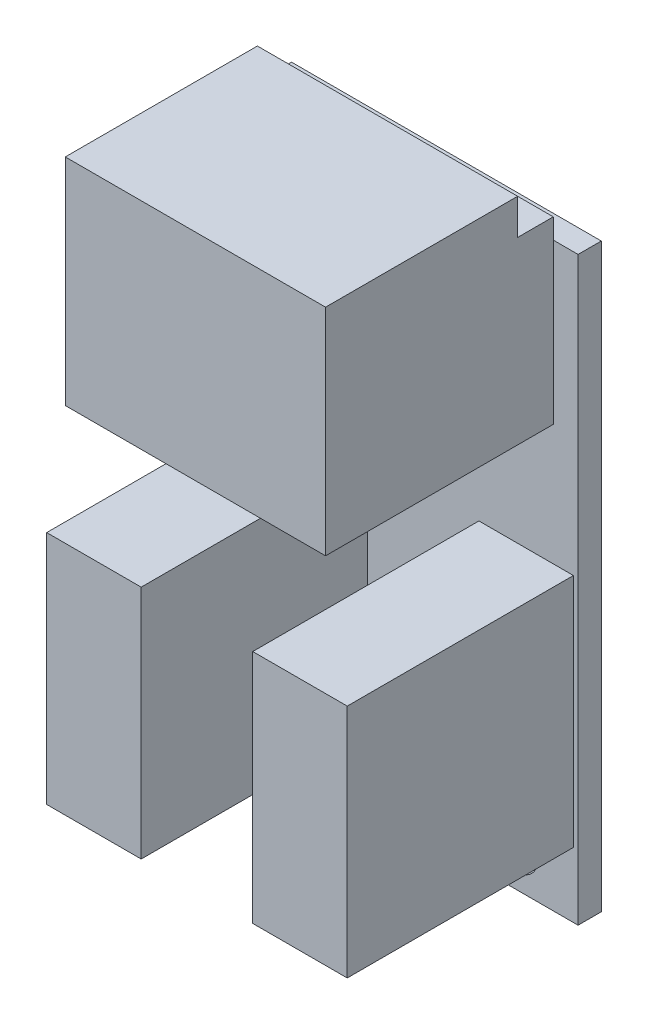
ISO-10303-21;
HEADER;
FILE_DESCRIPTION(('STEP AP214'),'2;1');
FILE_NAME('part.step','',(''),(''),'','','');
FILE_SCHEMA(('AUTOMOTIVE_DESIGN { 1 0 10303 214 1 1 1 1 }'));
ENDSEC;
DATA;
#1=APPLICATION_CONTEXT('core data for automotive mechanical design processes');
#2=APPLICATION_PROTOCOL_DEFINITION('international standard','automotive_design',2000,#1);
#3=PRODUCT_CONTEXT('',#1,'mechanical');
#4=PRODUCT('Part','Part','',(#3));
#5=PRODUCT_RELATED_PRODUCT_CATEGORY('part','',(#4));
#6=PRODUCT_DEFINITION_FORMATION('','',#4);
#7=PRODUCT_DEFINITION_CONTEXT('part definition',#1,'design');
#8=PRODUCT_DEFINITION('design','',#6,#7);
#9=PRODUCT_DEFINITION_SHAPE('','',#8);
#10=(LENGTH_UNIT() NAMED_UNIT(*) SI_UNIT(.MILLI.,.METRE.));
#11=(NAMED_UNIT(*) PLANE_ANGLE_UNIT() SI_UNIT($,.RADIAN.));
#12=(NAMED_UNIT(*) SI_UNIT($,.STERADIAN.) SOLID_ANGLE_UNIT());
#13=UNCERTAINTY_MEASURE_WITH_UNIT(LENGTH_MEASURE(1.E-05),#10,'distance_accuracy_value','');
#14=(GEOMETRIC_REPRESENTATION_CONTEXT(3) GLOBAL_UNCERTAINTY_ASSIGNED_CONTEXT((#13)) GLOBAL_UNIT_ASSIGNED_CONTEXT((#10,
#11,#12)) REPRESENTATION_CONTEXT('',''));
#15=CARTESIAN_POINT('',(0.,0.,0.));
#16=DIRECTION('',(0.,0.,1.));
#17=DIRECTION('',(1.,0.,0.));
#18=AXIS2_PLACEMENT_3D('',#15,#16,#17);
#19=CARTESIAN_POINT('',(-9.99999999999999,18.75,1.5));
#20=DIRECTION('',(0.,0.,1.));
#21=DIRECTION('',(1.,0.,0.));
#22=AXIS2_PLACEMENT_3D('',#19,#20,#21);
#23=PLANE('',#22);
#24=DIRECTION('',(1.,0.,0.));
#25=VECTOR('',#24,1.);
#26=CARTESIAN_POINT('',(-9.69999999999999,-14.55,1.5));
#27=LINE('',#26,#25);
#28=CARTESIAN_POINT('',(-9.69999999999999,-14.55,1.5));
#29=VERTEX_POINT('',#28);
#30=CARTESIAN_POINT('',(-3.59999999999999,-14.55,1.5));
#31=VERTEX_POINT('',#30);
#32=EDGE_CURVE('E194',#29,#31,#27,.T.);
#33=ORIENTED_EDGE('',*,*,#32,.F.);
#34=DIRECTION('',(0.,-1.,0.));
#35=VECTOR('',#34,1.);
#36=CARTESIAN_POINT('',(-9.7,0.650000000000003,1.5));
#37=LINE('',#36,#35);
#38=CARTESIAN_POINT('',(-9.7,0.650000000000003,1.5));
#39=VERTEX_POINT('',#38);
#40=EDGE_CURVE('E191',#39,#29,#37,.T.);
#41=ORIENTED_EDGE('',*,*,#40,.F.);
#42=DIRECTION('',(-1.,0.,0.));
#43=VECTOR('',#42,1.);
#44=CARTESIAN_POINT('',(-9.7,0.650000000000003,1.5));
#45=LINE('',#44,#43);
#46=CARTESIAN_POINT('',(-3.6,0.650000000000001,1.5));
#47=VERTEX_POINT('',#46);
#48=EDGE_CURVE('E203',#47,#39,#45,.T.);
#49=ORIENTED_EDGE('',*,*,#48,.F.);
#50=DIRECTION('',(0.,1.,0.));
#51=VECTOR('',#50,1.);
#52=CARTESIAN_POINT('',(-3.6,0.650000000000003,1.5));
#53=LINE('',#52,#51);
#54=EDGE_CURVE('E211',#31,#47,#53,.T.);
#55=ORIENTED_EDGE('',*,*,#54,.F.);
#56=EDGE_LOOP('',(#33,#41,#49,#55));
#57=FACE_BOUND('',#56,.T.);
#58=DIRECTION('',(0.,-1.,0.));
#59=VECTOR('',#58,1.);
#60=CARTESIAN_POINT('',(-8.4,8.45,1.5));
#61=LINE('',#60,#59);
#62=CARTESIAN_POINT('',(-8.4,18.75,1.5));
#63=VERTEX_POINT('',#62);
#64=CARTESIAN_POINT('',(-8.4,8.45,1.5));
#65=VERTEX_POINT('',#64);
#66=EDGE_CURVE('E11',#63,#65,#61,.T.);
#67=ORIENTED_EDGE('',*,*,#66,.F.);
#68=DIRECTION('',(-1.,0.,0.));
#69=VECTOR('',#68,1.);
#70=CARTESIAN_POINT('',(10.,18.75,1.5));
#71=LINE('',#70,#69);
#72=CARTESIAN_POINT('',(-9.99999999999999,18.75,1.5));
#73=VERTEX_POINT('',#72);
#74=EDGE_CURVE('E300',#63,#73,#71,.T.);
#75=ORIENTED_EDGE('',*,*,#74,.T.);
#76=DIRECTION('',(0.,-1.,0.));
#77=VECTOR('',#76,1.);
#78=CARTESIAN_POINT('',(-9.99999999999999,-18.75,1.5));
#79=LINE('',#78,#77);
#80=CARTESIAN_POINT('',(-9.99999999999999,-18.75,1.5));
#81=VERTEX_POINT('',#80);
#82=EDGE_CURVE('E289',#73,#81,#79,.T.);
#83=ORIENTED_EDGE('',*,*,#82,.T.);
#84=DIRECTION('',(1.,0.,0.));
#85=VECTOR('',#84,1.);
#86=CARTESIAN_POINT('',(10.,-18.75,1.5));
#87=LINE('',#86,#85);
#88=CARTESIAN_POINT('',(10.,-18.75,1.5));
#89=VERTEX_POINT('',#88);
#90=EDGE_CURVE('E303',#81,#89,#87,.T.);
#91=ORIENTED_EDGE('',*,*,#90,.T.);
#92=DIRECTION('',(0.,1.,0.));
#93=VECTOR('',#92,1.);
#94=CARTESIAN_POINT('',(10.,-18.75,1.5));
#95=LINE('',#94,#93);
#96=CARTESIAN_POINT('',(10.,18.75,1.5));
#97=VERTEX_POINT('',#96);
#98=EDGE_CURVE('E301',#89,#97,#95,.T.);
#99=ORIENTED_EDGE('',*,*,#98,.T.);
#100=CARTESIAN_POINT('',(8.4,18.75,1.5));
#101=VERTEX_POINT('',#100);
#102=EDGE_CURVE('E286',#97,#101,#71,.T.);
#103=ORIENTED_EDGE('',*,*,#102,.T.);
#104=DIRECTION('',(0.,1.,0.));
#105=VECTOR('',#104,1.);
#106=CARTESIAN_POINT('',(8.4,8.45000000000001,1.5));
#107=LINE('',#106,#105);
#108=CARTESIAN_POINT('',(8.4,8.45000000000001,1.5));
#109=VERTEX_POINT('',#108);
#110=EDGE_CURVE('E318',#109,#101,#107,.T.);
#111=ORIENTED_EDGE('',*,*,#110,.F.);
#112=DIRECTION('',(1.,0.,0.));
#113=VECTOR('',#112,1.);
#114=CARTESIAN_POINT('',(8.4,8.45000000000001,1.5));
#115=LINE('',#114,#113);
#116=EDGE_CURVE('E249',#65,#109,#115,.T.);
#117=ORIENTED_EDGE('',*,*,#116,.F.);
#118=EDGE_LOOP('',(#67,#75,#83,#91,#99,#103,#111,#117));
#119=FACE_BOUND('',#118,.T.);
#120=CARTESIAN_POINT('',(-6.05,-16.4,1.5));
#121=DIRECTION('',(0.,0.,1.));
#122=DIRECTION('',(1.,0.,0.));
#123=AXIS2_PLACEMENT_3D('',#120,#121,#122);
#124=CIRCLE('',#123,1.35);
#125=CARTESIAN_POINT('',(-4.7,-16.4,1.5));
#126=VERTEX_POINT('',#125);
#127=EDGE_CURVE('E297',#126,#126,#124,.T.);
#128=ORIENTED_EDGE('',*,*,#127,.F.);
#129=EDGE_LOOP('',(#128));
#130=FACE_BOUND('',#129,.T.);
#131=CARTESIAN_POINT('',(6.05,-16.4,1.5));
#132=DIRECTION('',(0.,0.,1.));
#133=DIRECTION('',(1.,0.,0.));
#134=AXIS2_PLACEMENT_3D('',#131,#132,#133);
#135=CIRCLE('',#134,1.35);
#136=CARTESIAN_POINT('',(7.4,-16.4,1.5));
#137=VERTEX_POINT('',#136);
#138=EDGE_CURVE('E310',#137,#137,#135,.T.);
#139=ORIENTED_EDGE('',*,*,#138,.F.);
#140=EDGE_LOOP('',(#139));
#141=FACE_BOUND('',#140,.T.);
#142=DIRECTION('',(-1.,0.,0.));
#143=VECTOR('',#142,1.);
#144=CARTESIAN_POINT('',(9.7,0.650000000000003,1.5));
#145=LINE('',#144,#143);
#146=CARTESIAN_POINT('',(9.7,0.650000000000003,1.5));
#147=VERTEX_POINT('',#146);
#148=CARTESIAN_POINT('',(3.6,0.650000000000002,1.5));
#149=VERTEX_POINT('',#148);
#150=EDGE_CURVE('E608',#147,#149,#145,.T.);
#151=ORIENTED_EDGE('',*,*,#150,.F.);
#152=DIRECTION('',(0.,1.,0.));
#153=VECTOR('',#152,1.);
#154=CARTESIAN_POINT('',(9.7,0.650000000000003,1.5));
#155=LINE('',#154,#153);
#156=CARTESIAN_POINT('',(9.7,-14.55,1.5));
#157=VERTEX_POINT('',#156);
#158=EDGE_CURVE('E189',#157,#147,#155,.T.);
#159=ORIENTED_EDGE('',*,*,#158,.F.);
#160=DIRECTION('',(1.,0.,0.));
#161=VECTOR('',#160,1.);
#162=CARTESIAN_POINT('',(9.7,-14.55,1.5));
#163=LINE('',#162,#161);
#164=CARTESIAN_POINT('',(3.6,-14.55,1.5));
#165=VERTEX_POINT('',#164);
#166=EDGE_CURVE('E185',#165,#157,#163,.T.);
#167=ORIENTED_EDGE('',*,*,#166,.F.);
#168=DIRECTION('',(0.,-1.,0.));
#169=VECTOR('',#168,1.);
#170=CARTESIAN_POINT('',(3.6,0.650000000000002,1.5));
#171=LINE('',#170,#169);
#172=EDGE_CURVE('E610',#149,#165,#171,.T.);
#173=ORIENTED_EDGE('',*,*,#172,.F.);
#174=EDGE_LOOP('',(#151,#159,#167,#173));
#175=FACE_BOUND('',#174,.T.);
#176=ADVANCED_FACE('F31',(#57,#119,#130,#141,#175),#23,.T.);
#177=CARTESIAN_POINT('',(-9.99999999999999,18.75,0.));
#178=DIRECTION('',(0.,0.,1.));
#179=DIRECTION('',(1.,0.,0.));
#180=AXIS2_PLACEMENT_3D('',#177,#178,#179);
#181=PLANE('',#180);
#182=CARTESIAN_POINT('',(-6.05,-16.4,0.));
#183=DIRECTION('',(0.,0.,1.));
#184=DIRECTION('',(1.,0.,0.));
#185=AXIS2_PLACEMENT_3D('',#182,#183,#184);
#186=CIRCLE('',#185,1.35);
#187=CARTESIAN_POINT('',(-4.7,-16.4,0.));
#188=VERTEX_POINT('',#187);
#189=EDGE_CURVE('E307',#188,#188,#186,.T.);
#190=ORIENTED_EDGE('',*,*,#189,.T.);
#191=EDGE_LOOP('',(#190));
#192=FACE_BOUND('',#191,.T.);
#193=DIRECTION('',(0.,-1.,0.));
#194=VECTOR('',#193,1.);
#195=CARTESIAN_POINT('',(-9.99999999999999,-18.75,0.));
#196=LINE('',#195,#194);
#197=CARTESIAN_POINT('',(-9.99999999999999,18.75,0.));
#198=VERTEX_POINT('',#197);
#199=CARTESIAN_POINT('',(-9.99999999999999,-18.75,0.));
#200=VERTEX_POINT('',#199);
#201=EDGE_CURVE('E294',#198,#200,#196,.T.);
#202=ORIENTED_EDGE('',*,*,#201,.F.);
#203=DIRECTION('',(-1.,0.,0.));
#204=VECTOR('',#203,1.);
#205=CARTESIAN_POINT('',(10.,18.75,0.));
#206=LINE('',#205,#204);
#207=CARTESIAN_POINT('',(10.,18.75,0.));
#208=VERTEX_POINT('',#207);
#209=EDGE_CURVE('E287',#208,#198,#206,.T.);
#210=ORIENTED_EDGE('',*,*,#209,.F.);
#211=DIRECTION('',(0.,1.,0.));
#212=VECTOR('',#211,1.);
#213=CARTESIAN_POINT('',(10.,-18.75,0.));
#214=LINE('',#213,#212);
#215=CARTESIAN_POINT('',(10.,-18.75,0.));
#216=VERTEX_POINT('',#215);
#217=EDGE_CURVE('E290',#216,#208,#214,.T.);
#218=ORIENTED_EDGE('',*,*,#217,.F.);
#219=DIRECTION('',(1.,0.,0.));
#220=VECTOR('',#219,1.);
#221=CARTESIAN_POINT('',(10.,-18.75,0.));
#222=LINE('',#221,#220);
#223=EDGE_CURVE('E292',#200,#216,#222,.T.);
#224=ORIENTED_EDGE('',*,*,#223,.F.);
#225=EDGE_LOOP('',(#202,#210,#218,#224));
#226=FACE_BOUND('',#225,.T.);
#227=CARTESIAN_POINT('',(6.05,-16.4,0.));
#228=DIRECTION('',(0.,0.,1.));
#229=DIRECTION('',(1.,0.,0.));
#230=AXIS2_PLACEMENT_3D('',#227,#228,#229);
#231=CIRCLE('',#230,1.35);
#232=CARTESIAN_POINT('',(7.4,-16.4,0.));
#233=VERTEX_POINT('',#232);
#234=EDGE_CURVE('E266',#233,#233,#231,.T.);
#235=ORIENTED_EDGE('',*,*,#234,.T.);
#236=EDGE_LOOP('',(#235));
#237=FACE_BOUND('',#236,.T.);
#238=ADVANCED_FACE('F352',(#192,#226,#237),#181,.F.);
#239=CARTESIAN_POINT('',(-9.99999999999999,-18.75,1.5));
#240=DIRECTION('',(1.,0.,0.));
#241=DIRECTION('',(0.,0.,-1.));
#242=AXIS2_PLACEMENT_3D('',#239,#240,#241);
#243=PLANE('',#242);
#244=ORIENTED_EDGE('',*,*,#201,.T.);
#245=DIRECTION('',(0.,0.,-1.));
#246=VECTOR('',#245,1.);
#247=CARTESIAN_POINT('',(-9.99999999999999,-18.75,1.5));
#248=LINE('',#247,#246);
#249=EDGE_CURVE('E40',#81,#200,#248,.T.);
#250=ORIENTED_EDGE('',*,*,#249,.F.);
#251=ORIENTED_EDGE('',*,*,#82,.F.);
#252=DIRECTION('',(0.,0.,-1.));
#253=VECTOR('',#252,1.);
#254=CARTESIAN_POINT('',(-9.99999999999999,18.75,1.5));
#255=LINE('',#254,#253);
#256=EDGE_CURVE('E283',#73,#198,#255,.T.);
#257=ORIENTED_EDGE('',*,*,#256,.T.);
#258=EDGE_LOOP('',(#244,#250,#251,#257));
#259=FACE_BOUND('',#258,.T.);
#260=ADVANCED_FACE('F33',(#259),#243,.F.);
#261=CARTESIAN_POINT('',(10.,-18.75,1.5));
#262=DIRECTION('',(0.,1.,0.));
#263=DIRECTION('',(-1.,0.,0.));
#264=AXIS2_PLACEMENT_3D('',#261,#262,#263);
#265=PLANE('',#264);
#266=ORIENTED_EDGE('',*,*,#223,.T.);
#267=DIRECTION('',(0.,0.,-1.));
#268=VECTOR('',#267,1.);
#269=CARTESIAN_POINT('',(10.,-18.75,1.5));
#270=LINE('',#269,#268);
#271=EDGE_CURVE('E277',#89,#216,#270,.T.);
#272=ORIENTED_EDGE('',*,*,#271,.F.);
#273=ORIENTED_EDGE('',*,*,#90,.F.);
#274=ORIENTED_EDGE('',*,*,#249,.T.);
#275=EDGE_LOOP('',(#266,#272,#273,#274));
#276=FACE_BOUND('',#275,.T.);
#277=ADVANCED_FACE('F372',(#276),#265,.F.);
#278=CARTESIAN_POINT('',(10.,-18.75,1.5));
#279=DIRECTION('',(-1.,0.,0.));
#280=DIRECTION('',(0.,0.,1.));
#281=AXIS2_PLACEMENT_3D('',#278,#279,#280);
#282=PLANE('',#281);
#283=ORIENTED_EDGE('',*,*,#217,.T.);
#284=DIRECTION('',(0.,0.,-1.));
#285=VECTOR('',#284,1.);
#286=CARTESIAN_POINT('',(10.,18.75,1.5));
#287=LINE('',#286,#285);
#288=EDGE_CURVE('E280',#97,#208,#287,.T.);
#289=ORIENTED_EDGE('',*,*,#288,.F.);
#290=ORIENTED_EDGE('',*,*,#98,.F.);
#291=ORIENTED_EDGE('',*,*,#271,.T.);
#292=EDGE_LOOP('',(#283,#289,#290,#291));
#293=FACE_BOUND('',#292,.T.);
#294=ADVANCED_FACE('F369',(#293),#282,.F.);
#295=CARTESIAN_POINT('',(10.,18.75,1.5));
#296=DIRECTION('',(0.,-1.,0.));
#297=DIRECTION('',(1.,0.,0.));
#298=AXIS2_PLACEMENT_3D('',#295,#296,#297);
#299=PLANE('',#298);
#300=ORIENTED_EDGE('',*,*,#209,.T.);
#301=ORIENTED_EDGE('',*,*,#256,.F.);
#302=ORIENTED_EDGE('',*,*,#74,.F.);
#303=EDGE_CURVE('E299',#101,#63,#71,.T.);
#304=ORIENTED_EDGE('',*,*,#303,.F.);
#305=ORIENTED_EDGE('',*,*,#102,.F.);
#306=ORIENTED_EDGE('',*,*,#288,.T.);
#307=EDGE_LOOP('',(#300,#301,#302,#304,#305,#306));
#308=FACE_BOUND('',#307,.T.);
#309=ADVANCED_FACE('F366',(#308),#299,.F.);
#310=CARTESIAN_POINT('',(-6.05,-16.4,1.5));
#311=DIRECTION('',(0.,0.,-1.));
#312=DIRECTION('',(-1.,0.,0.));
#313=AXIS2_PLACEMENT_3D('',#310,#311,#312);
#314=CYLINDRICAL_SURFACE('',#313,1.35);
#315=ORIENTED_EDGE('',*,*,#127,.T.);
#316=EDGE_LOOP('',(#315));
#317=FACE_BOUND('',#316,.T.);
#318=ORIENTED_EDGE('',*,*,#189,.F.);
#319=EDGE_LOOP('',(#318));
#320=FACE_BOUND('',#319,.T.);
#321=ADVANCED_FACE('F363',(#317,#320),#314,.F.);
#322=CARTESIAN_POINT('',(6.05,-16.4,1.5));
#323=DIRECTION('',(0.,0.,-1.));
#324=DIRECTION('',(-1.,0.,0.));
#325=AXIS2_PLACEMENT_3D('',#322,#323,#324);
#326=CYLINDRICAL_SURFACE('',#325,1.35);
#327=ORIENTED_EDGE('',*,*,#138,.T.);
#328=EDGE_LOOP('',(#327));
#329=FACE_BOUND('',#328,.T.);
#330=ORIENTED_EDGE('',*,*,#234,.F.);
#331=EDGE_LOOP('',(#330));
#332=FACE_BOUND('',#331,.T.);
#333=ADVANCED_FACE('F546',(#329,#332),#326,.F.);
#334=CARTESIAN_POINT('',(8.4,8.45000000000001,3.8));
#335=DIRECTION('',(0.,1.,0.));
#336=DIRECTION('',(-1.,0.,0.));
#337=AXIS2_PLACEMENT_3D('',#334,#335,#336);
#338=PLANE('',#337);
#339=ORIENTED_EDGE('',*,*,#116,.T.);
#340=DIRECTION('',(0.,0.,-1.));
#341=VECTOR('',#340,1.);
#342=CARTESIAN_POINT('',(8.4,8.45000000000001,3.8));
#343=LINE('',#342,#341);
#344=CARTESIAN_POINT('',(8.4,8.45,16.2));
#345=VERTEX_POINT('',#344);
#346=EDGE_CURVE('E260',#345,#109,#343,.T.);
#347=ORIENTED_EDGE('',*,*,#346,.F.);
#348=DIRECTION('',(1.,0.,0.));
#349=VECTOR('',#348,1.);
#350=CARTESIAN_POINT('',(-8.4,8.45,16.2));
#351=LINE('',#350,#349);
#352=CARTESIAN_POINT('',(-8.4,8.45,16.2));
#353=VERTEX_POINT('',#352);
#354=EDGE_CURVE('E226',#353,#345,#351,.T.);
#355=ORIENTED_EDGE('',*,*,#354,.F.);
#356=DIRECTION('',(0.,0.,-1.));
#357=VECTOR('',#356,1.);
#358=CARTESIAN_POINT('',(-8.4,8.45,3.8));
#359=LINE('',#358,#357);
#360=EDGE_CURVE('E255',#353,#65,#359,.T.);
#361=ORIENTED_EDGE('',*,*,#360,.T.);
#362=EDGE_LOOP('',(#339,#347,#355,#361));
#363=FACE_BOUND('',#362,.T.);
#364=ADVANCED_FACE('F398',(#363),#338,.F.);
#365=CARTESIAN_POINT('',(8.4,8.45000000000001,3.8));
#366=DIRECTION('',(-1.,0.,0.));
#367=DIRECTION('',(0.,-1.,0.));
#368=AXIS2_PLACEMENT_3D('',#365,#366,#367);
#369=PLANE('',#368);
#370=ORIENTED_EDGE('',*,*,#110,.T.);
#371=CARTESIAN_POINT('',(8.4,20.05,1.5));
#372=VERTEX_POINT('',#371);
#373=EDGE_CURVE('E320',#101,#372,#107,.T.);
#374=ORIENTED_EDGE('',*,*,#373,.T.);
#375=DIRECTION('',(0.,0.,-1.));
#376=VECTOR('',#375,1.);
#377=CARTESIAN_POINT('',(8.4,20.05,3.8));
#378=LINE('',#377,#376);
#379=CARTESIAN_POINT('',(8.4,20.05,3.8));
#380=VERTEX_POINT('',#379);
#381=EDGE_CURVE('E258',#380,#372,#378,.T.);
#382=ORIENTED_EDGE('',*,*,#381,.F.);
#383=DIRECTION('',(0.,1.,0.));
#384=VECTOR('',#383,1.);
#385=CARTESIAN_POINT('',(8.4,8.45,3.8));
#386=LINE('',#385,#384);
#387=CARTESIAN_POINT('',(8.4,22.35,3.8));
#388=VERTEX_POINT('',#387);
#389=EDGE_CURVE('E243',#380,#388,#386,.T.);
#390=ORIENTED_EDGE('',*,*,#389,.T.);
#391=DIRECTION('',(0.,0.,-1.));
#392=VECTOR('',#391,1.);
#393=CARTESIAN_POINT('',(8.4,22.35,16.2));
#394=LINE('',#393,#392);
#395=CARTESIAN_POINT('',(8.4,22.35,16.2));
#396=VERTEX_POINT('',#395);
#397=EDGE_CURVE('E244',#396,#388,#394,.T.);
#398=ORIENTED_EDGE('',*,*,#397,.F.);
#399=DIRECTION('',(0.,1.,0.));
#400=VECTOR('',#399,1.);
#401=CARTESIAN_POINT('',(8.4,8.45,16.2));
#402=LINE('',#401,#400);
#403=EDGE_CURVE('E230',#345,#396,#402,.T.);
#404=ORIENTED_EDGE('',*,*,#403,.F.);
#405=ORIENTED_EDGE('',*,*,#346,.T.);
#406=EDGE_LOOP('',(#370,#374,#382,#390,#398,#404,#405));
#407=FACE_BOUND('',#406,.T.);
#408=ADVANCED_FACE('F349',(#407),#369,.F.);
#409=CARTESIAN_POINT('',(8.4,20.05,3.8));
#410=DIRECTION('',(0.,-1.,0.));
#411=DIRECTION('',(1.,0.,0.));
#412=AXIS2_PLACEMENT_3D('',#409,#410,#411);
#413=PLANE('',#412);
#414=DIRECTION('',(-1.,0.,0.));
#415=VECTOR('',#414,1.);
#416=CARTESIAN_POINT('',(8.4,20.05,1.5));
#417=LINE('',#416,#415);
#418=CARTESIAN_POINT('',(-8.4,20.05,1.5));
#419=VERTEX_POINT('',#418);
#420=EDGE_CURVE('E317',#372,#419,#417,.T.);
#421=ORIENTED_EDGE('',*,*,#420,.T.);
#422=DIRECTION('',(0.,0.,-1.));
#423=VECTOR('',#422,1.);
#424=CARTESIAN_POINT('',(-8.4,20.05,3.8));
#425=LINE('',#424,#423);
#426=CARTESIAN_POINT('',(-8.4,20.05,3.8));
#427=VERTEX_POINT('',#426);
#428=EDGE_CURVE('E261',#427,#419,#425,.T.);
#429=ORIENTED_EDGE('',*,*,#428,.F.);
#430=DIRECTION('',(-1.,0.,0.));
#431=VECTOR('',#430,1.);
#432=CARTESIAN_POINT('',(8.4,20.05,3.8));
#433=LINE('',#432,#431);
#434=EDGE_CURVE('E252',#380,#427,#433,.T.);
#435=ORIENTED_EDGE('',*,*,#434,.F.);
#436=ORIENTED_EDGE('',*,*,#381,.T.);
#437=EDGE_LOOP('',(#421,#429,#435,#436));
#438=FACE_BOUND('',#437,.T.);
#439=ADVANCED_FACE('F341',(#438),#413,.F.);
#440=CARTESIAN_POINT('',(-8.4,8.45,3.8));
#441=DIRECTION('',(1.,0.,0.));
#442=DIRECTION('',(0.,1.,0.));
#443=AXIS2_PLACEMENT_3D('',#440,#441,#442);
#444=PLANE('',#443);
#445=EDGE_CURVE('E42',#419,#63,#61,.T.);
#446=ORIENTED_EDGE('',*,*,#445,.T.);
#447=ORIENTED_EDGE('',*,*,#66,.T.);
#448=ORIENTED_EDGE('',*,*,#360,.F.);
#449=DIRECTION('',(0.,-1.,0.));
#450=VECTOR('',#449,1.);
#451=CARTESIAN_POINT('',(-8.4,8.45,16.2));
#452=LINE('',#451,#450);
#453=CARTESIAN_POINT('',(-8.4,22.35,16.2));
#454=VERTEX_POINT('',#453);
#455=EDGE_CURVE('E223',#454,#353,#452,.T.);
#456=ORIENTED_EDGE('',*,*,#455,.F.);
#457=DIRECTION('',(0.,0.,-1.));
#458=VECTOR('',#457,1.);
#459=CARTESIAN_POINT('',(-8.4,22.35,16.2));
#460=LINE('',#459,#458);
#461=CARTESIAN_POINT('',(-8.4,22.35,3.8));
#462=VERTEX_POINT('',#461);
#463=EDGE_CURVE('E234',#454,#462,#460,.T.);
#464=ORIENTED_EDGE('',*,*,#463,.T.);
#465=DIRECTION('',(0.,-1.,0.));
#466=VECTOR('',#465,1.);
#467=CARTESIAN_POINT('',(-8.4,8.45,3.8));
#468=LINE('',#467,#466);
#469=EDGE_CURVE('E222',#462,#427,#468,.T.);
#470=ORIENTED_EDGE('',*,*,#469,.T.);
#471=ORIENTED_EDGE('',*,*,#428,.T.);
#472=EDGE_LOOP('',(#446,#447,#448,#456,#464,#470,#471));
#473=FACE_BOUND('',#472,.T.);
#474=ADVANCED_FACE('F338',(#473),#444,.F.);
#475=CARTESIAN_POINT('',(-8.4,8.45,1.5));
#476=DIRECTION('',(0.,0.,-1.));
#477=DIRECTION('',(-1.,0.,0.));
#478=AXIS2_PLACEMENT_3D('',#475,#476,#477);
#479=PLANE('',#478);
#480=ORIENTED_EDGE('',*,*,#373,.F.);
#481=ORIENTED_EDGE('',*,*,#303,.T.);
#482=ORIENTED_EDGE('',*,*,#445,.F.);
#483=ORIENTED_EDGE('',*,*,#420,.F.);
#484=EDGE_LOOP('',(#480,#481,#482,#483));
#485=FACE_BOUND('',#484,.T.);
#486=ADVANCED_FACE('F340',(#485),#479,.T.);
#487=CARTESIAN_POINT('',(-8.4,22.35,16.2));
#488=DIRECTION('',(0.,-1.,0.));
#489=DIRECTION('',(0.,0.,-1.));
#490=AXIS2_PLACEMENT_3D('',#487,#488,#489);
#491=PLANE('',#490);
#492=DIRECTION('',(-1.,0.,0.));
#493=VECTOR('',#492,1.);
#494=CARTESIAN_POINT('',(-8.4,22.35,3.8));
#495=LINE('',#494,#493);
#496=EDGE_CURVE('E227',#388,#462,#495,.T.);
#497=ORIENTED_EDGE('',*,*,#496,.T.);
#498=ORIENTED_EDGE('',*,*,#463,.F.);
#499=DIRECTION('',(-1.,0.,0.));
#500=VECTOR('',#499,1.);
#501=CARTESIAN_POINT('',(-8.4,22.35,16.2));
#502=LINE('',#501,#500);
#503=EDGE_CURVE('E232',#396,#454,#502,.T.);
#504=ORIENTED_EDGE('',*,*,#503,.F.);
#505=ORIENTED_EDGE('',*,*,#397,.T.);
#506=EDGE_LOOP('',(#497,#498,#504,#505));
#507=FACE_BOUND('',#506,.T.);
#508=ADVANCED_FACE('F334',(#507),#491,.F.);
#509=CARTESIAN_POINT('',(-8.4,22.35,16.2));
#510=DIRECTION('',(0.,0.,-1.));
#511=DIRECTION('',(-1.,0.,0.));
#512=AXIS2_PLACEMENT_3D('',#509,#510,#511);
#513=PLANE('',#512);
#514=ORIENTED_EDGE('',*,*,#455,.T.);
#515=ORIENTED_EDGE('',*,*,#354,.T.);
#516=ORIENTED_EDGE('',*,*,#403,.T.);
#517=ORIENTED_EDGE('',*,*,#503,.T.);
#518=EDGE_LOOP('',(#514,#515,#516,#517));
#519=FACE_BOUND('',#518,.T.);
#520=ADVANCED_FACE('F400',(#519),#513,.F.);
#521=CARTESIAN_POINT('',(-8.4,22.35,3.8));
#522=DIRECTION('',(0.,0.,-1.));
#523=DIRECTION('',(-1.,0.,0.));
#524=AXIS2_PLACEMENT_3D('',#521,#522,#523);
#525=PLANE('',#524);
#526=ORIENTED_EDGE('',*,*,#389,.F.);
#527=ORIENTED_EDGE('',*,*,#434,.T.);
#528=ORIENTED_EDGE('',*,*,#469,.F.);
#529=ORIENTED_EDGE('',*,*,#496,.F.);
#530=EDGE_LOOP('',(#526,#527,#528,#529));
#531=FACE_BOUND('',#530,.T.);
#532=ADVANCED_FACE('F337',(#531),#525,.T.);
#533=CARTESIAN_POINT('',(-9.7,0.650000000000003,16.1));
#534=DIRECTION('',(1.,0.,0.));
#535=DIRECTION('',(0.,1.,0.));
#536=AXIS2_PLACEMENT_3D('',#533,#534,#535);
#537=PLANE('',#536);
#538=ORIENTED_EDGE('',*,*,#40,.T.);
#539=DIRECTION('',(0.,0.,-1.));
#540=VECTOR('',#539,1.);
#541=CARTESIAN_POINT('',(-9.69999999999999,-14.55,16.1));
#542=LINE('',#541,#540);
#543=CARTESIAN_POINT('',(-9.69999999999999,-14.55,16.1));
#544=VERTEX_POINT('',#543);
#545=EDGE_CURVE('E220',#544,#29,#542,.T.);
#546=ORIENTED_EDGE('',*,*,#545,.F.);
#547=DIRECTION('',(0.,-1.,0.));
#548=VECTOR('',#547,1.);
#549=CARTESIAN_POINT('',(-9.7,0.650000000000003,16.1));
#550=LINE('',#549,#548);
#551=CARTESIAN_POINT('',(-9.7,0.650000000000003,16.1));
#552=VERTEX_POINT('',#551);
#553=EDGE_CURVE('E199',#552,#544,#550,.T.);
#554=ORIENTED_EDGE('',*,*,#553,.F.);
#555=DIRECTION('',(0.,0.,-1.));
#556=VECTOR('',#555,1.);
#557=CARTESIAN_POINT('',(-9.7,0.650000000000003,16.1));
#558=LINE('',#557,#556);
#559=EDGE_CURVE('E208',#552,#39,#558,.T.);
#560=ORIENTED_EDGE('',*,*,#559,.T.);
#561=EDGE_LOOP('',(#538,#546,#554,#560));
#562=FACE_BOUND('',#561,.T.);
#563=ADVANCED_FACE('F407',(#562),#537,.F.);
#564=CARTESIAN_POINT('',(-9.69999999999999,-14.55,16.1));
#565=DIRECTION('',(0.,1.,0.));
#566=DIRECTION('',(0.,0.,1.));
#567=AXIS2_PLACEMENT_3D('',#564,#565,#566);
#568=PLANE('',#567);
#569=ORIENTED_EDGE('',*,*,#32,.T.);
#570=DIRECTION('',(0.,0.,-1.));
#571=VECTOR('',#570,1.);
#572=CARTESIAN_POINT('',(-3.59999999999999,-14.55,16.1));
#573=LINE('',#572,#571);
#574=CARTESIAN_POINT('',(-3.59999999999999,-14.55,16.1));
#575=VERTEX_POINT('',#574);
#576=EDGE_CURVE('E217',#575,#31,#573,.T.);
#577=ORIENTED_EDGE('',*,*,#576,.F.);
#578=DIRECTION('',(1.,0.,0.));
#579=VECTOR('',#578,1.);
#580=CARTESIAN_POINT('',(-9.69999999999999,-14.55,16.1));
#581=LINE('',#580,#579);
#582=EDGE_CURVE('E202',#544,#575,#581,.T.);
#583=ORIENTED_EDGE('',*,*,#582,.F.);
#584=ORIENTED_EDGE('',*,*,#545,.T.);
#585=EDGE_LOOP('',(#569,#577,#583,#584));
#586=FACE_BOUND('',#585,.T.);
#587=ADVANCED_FACE('F413',(#586),#568,.F.);
#588=CARTESIAN_POINT('',(-3.6,0.650000000000003,16.1));
#589=DIRECTION('',(-1.,0.,0.));
#590=DIRECTION('',(0.,-1.,0.));
#591=AXIS2_PLACEMENT_3D('',#588,#589,#590);
#592=PLANE('',#591);
#593=ORIENTED_EDGE('',*,*,#54,.T.);
#594=DIRECTION('',(0.,0.,-1.));
#595=VECTOR('',#594,1.);
#596=CARTESIAN_POINT('',(-3.6,0.650000000000003,16.1));
#597=LINE('',#596,#595);
#598=CARTESIAN_POINT('',(-3.6,0.650000000000003,16.1));
#599=VERTEX_POINT('',#598);
#600=EDGE_CURVE('E57',#599,#47,#597,.T.);
#601=ORIENTED_EDGE('',*,*,#600,.F.);
#602=DIRECTION('',(0.,1.,0.));
#603=VECTOR('',#602,1.);
#604=CARTESIAN_POINT('',(-3.6,0.650000000000003,16.1));
#605=LINE('',#604,#603);
#606=EDGE_CURVE('E205',#575,#599,#605,.T.);
#607=ORIENTED_EDGE('',*,*,#606,.F.);
#608=ORIENTED_EDGE('',*,*,#576,.T.);
#609=EDGE_LOOP('',(#593,#601,#607,#608));
#610=FACE_BOUND('',#609,.T.);
#611=ADVANCED_FACE('F417',(#610),#592,.F.);
#612=CARTESIAN_POINT('',(-9.7,0.650000000000003,16.1));
#613=DIRECTION('',(0.,-1.,0.));
#614=DIRECTION('',(1.,0.,0.));
#615=AXIS2_PLACEMENT_3D('',#612,#613,#614);
#616=PLANE('',#615);
#617=ORIENTED_EDGE('',*,*,#48,.T.);
#618=ORIENTED_EDGE('',*,*,#559,.F.);
#619=DIRECTION('',(-1.,0.,0.));
#620=VECTOR('',#619,1.);
#621=CARTESIAN_POINT('',(-9.7,0.650000000000003,16.1));
#622=LINE('',#621,#620);
#623=EDGE_CURVE('E207',#599,#552,#622,.T.);
#624=ORIENTED_EDGE('',*,*,#623,.F.);
#625=ORIENTED_EDGE('',*,*,#600,.T.);
#626=EDGE_LOOP('',(#617,#618,#624,#625));
#627=FACE_BOUND('',#626,.T.);
#628=ADVANCED_FACE('F421',(#627),#616,.F.);
#629=CARTESIAN_POINT('',(-9.69999999999999,-14.55,16.1));
#630=DIRECTION('',(0.,0.,1.));
#631=DIRECTION('',(1.,0.,0.));
#632=AXIS2_PLACEMENT_3D('',#629,#630,#631);
#633=PLANE('',#632);
#634=ORIENTED_EDGE('',*,*,#553,.T.);
#635=ORIENTED_EDGE('',*,*,#582,.T.);
#636=ORIENTED_EDGE('',*,*,#606,.T.);
#637=ORIENTED_EDGE('',*,*,#623,.T.);
#638=EDGE_LOOP('',(#634,#635,#636,#637));
#639=FACE_BOUND('',#638,.T.);
#640=ADVANCED_FACE('F425',(#639),#633,.T.);
#641=CARTESIAN_POINT('',(9.7,0.650000000000003,16.1));
#642=DIRECTION('',(-1.,0.,0.));
#643=DIRECTION('',(0.,-1.,0.));
#644=AXIS2_PLACEMENT_3D('',#641,#642,#643);
#645=PLANE('',#644);
#646=ORIENTED_EDGE('',*,*,#158,.T.);
#647=DIRECTION('',(0.,0.,-1.));
#648=VECTOR('',#647,1.);
#649=CARTESIAN_POINT('',(9.7,0.650000000000003,16.1));
#650=LINE('',#649,#648);
#651=CARTESIAN_POINT('',(9.7,0.650000000000003,16.1));
#652=VERTEX_POINT('',#651);
#653=EDGE_CURVE('E170',#652,#147,#650,.T.);
#654=ORIENTED_EDGE('',*,*,#653,.F.);
#655=DIRECTION('',(0.,1.,0.));
#656=VECTOR('',#655,1.);
#657=CARTESIAN_POINT('',(9.7,0.650000000000003,16.1));
#658=LINE('',#657,#656);
#659=CARTESIAN_POINT('',(9.7,-14.55,16.1));
#660=VERTEX_POINT('',#659);
#661=EDGE_CURVE('E177',#660,#652,#658,.T.);
#662=ORIENTED_EDGE('',*,*,#661,.F.);
#663=DIRECTION('',(0.,0.,-1.));
#664=VECTOR('',#663,1.);
#665=CARTESIAN_POINT('',(9.7,-14.55,16.1));
#666=LINE('',#665,#664);
#667=EDGE_CURVE('E617',#660,#157,#666,.T.);
#668=ORIENTED_EDGE('',*,*,#667,.T.);
#669=EDGE_LOOP('',(#646,#654,#662,#668));
#670=FACE_BOUND('',#669,.T.);
#671=ADVANCED_FACE('F187',(#670),#645,.F.);
#672=CARTESIAN_POINT('',(9.7,0.650000000000003,16.1));
#673=DIRECTION('',(0.,-1.,0.));
#674=DIRECTION('',(1.,0.,0.));
#675=AXIS2_PLACEMENT_3D('',#672,#673,#674);
#676=PLANE('',#675);
#677=ORIENTED_EDGE('',*,*,#150,.T.);
#678=DIRECTION('',(0.,0.,-1.));
#679=VECTOR('',#678,1.);
#680=CARTESIAN_POINT('',(3.6,0.650000000000002,16.1));
#681=LINE('',#680,#679);
#682=CARTESIAN_POINT('',(3.6,0.650000000000002,16.1));
#683=VERTEX_POINT('',#682);
#684=EDGE_CURVE('E173',#683,#149,#681,.T.);
#685=ORIENTED_EDGE('',*,*,#684,.F.);
#686=DIRECTION('',(-1.,0.,0.));
#687=VECTOR('',#686,1.);
#688=CARTESIAN_POINT('',(9.7,0.650000000000003,16.1));
#689=LINE('',#688,#687);
#690=EDGE_CURVE('E166',#652,#683,#689,.T.);
#691=ORIENTED_EDGE('',*,*,#690,.F.);
#692=ORIENTED_EDGE('',*,*,#653,.T.);
#693=EDGE_LOOP('',(#677,#685,#691,#692));
#694=FACE_BOUND('',#693,.T.);
#695=ADVANCED_FACE('F168',(#694),#676,.F.);
#696=CARTESIAN_POINT('',(3.6,0.650000000000002,16.1));
#697=DIRECTION('',(1.,0.,0.));
#698=DIRECTION('',(0.,1.,0.));
#699=AXIS2_PLACEMENT_3D('',#696,#697,#698);
#700=PLANE('',#699);
#701=ORIENTED_EDGE('',*,*,#172,.T.);
#702=DIRECTION('',(0.,0.,-1.));
#703=VECTOR('',#702,1.);
#704=CARTESIAN_POINT('',(3.6,-14.55,16.1));
#705=LINE('',#704,#703);
#706=CARTESIAN_POINT('',(3.6,-14.55,16.1));
#707=VERTEX_POINT('',#706);
#708=EDGE_CURVE('E49',#707,#165,#705,.T.);
#709=ORIENTED_EDGE('',*,*,#708,.F.);
#710=DIRECTION('',(0.,-1.,0.));
#711=VECTOR('',#710,1.);
#712=CARTESIAN_POINT('',(3.6,0.650000000000002,16.1));
#713=LINE('',#712,#711);
#714=EDGE_CURVE('E176',#683,#707,#713,.T.);
#715=ORIENTED_EDGE('',*,*,#714,.F.);
#716=ORIENTED_EDGE('',*,*,#684,.T.);
#717=EDGE_LOOP('',(#701,#709,#715,#716));
#718=FACE_BOUND('',#717,.T.);
#719=ADVANCED_FACE('F433',(#718),#700,.F.);
#720=CARTESIAN_POINT('',(9.7,-14.55,16.1));
#721=DIRECTION('',(0.,1.,0.));
#722=DIRECTION('',(0.,0.,1.));
#723=AXIS2_PLACEMENT_3D('',#720,#721,#722);
#724=PLANE('',#723);
#725=ORIENTED_EDGE('',*,*,#166,.T.);
#726=ORIENTED_EDGE('',*,*,#667,.F.);
#727=DIRECTION('',(1.,0.,0.));
#728=VECTOR('',#727,1.);
#729=CARTESIAN_POINT('',(9.7,-14.55,16.1));
#730=LINE('',#729,#728);
#731=EDGE_CURVE('E181',#707,#660,#730,.T.);
#732=ORIENTED_EDGE('',*,*,#731,.F.);
#733=ORIENTED_EDGE('',*,*,#708,.T.);
#734=EDGE_LOOP('',(#725,#726,#732,#733));
#735=FACE_BOUND('',#734,.T.);
#736=ADVANCED_FACE('F436',(#735),#724,.F.);
#737=CARTESIAN_POINT('',(9.7,-14.55,16.1));
#738=DIRECTION('',(0.,0.,-1.));
#739=DIRECTION('',(-1.,0.,0.));
#740=AXIS2_PLACEMENT_3D('',#737,#738,#739);
#741=PLANE('',#740);
#742=ORIENTED_EDGE('',*,*,#661,.T.);
#743=ORIENTED_EDGE('',*,*,#690,.T.);
#744=ORIENTED_EDGE('',*,*,#714,.T.);
#745=ORIENTED_EDGE('',*,*,#731,.T.);
#746=EDGE_LOOP('',(#742,#743,#744,#745));
#747=FACE_BOUND('',#746,.T.);
#748=ADVANCED_FACE('F180',(#747),#741,.F.);
#749=CLOSED_SHELL('',(#176,#238,#260,#277,#294,#309,#321,#333,#364,#408,#439,#474,#486,#508,
#520,#532,#563,#587,#611,#628,#640,#671,#695,#719,#736,#748));
#750=MANIFOLD_SOLID_BREP('B2',#749);
#751=ADVANCED_BREP_SHAPE_REPRESENTATION('',(#18,#750),#14);
#752=SHAPE_DEFINITION_REPRESENTATION(#9,#751);
ENDSEC;
END-ISO-10303-21;
